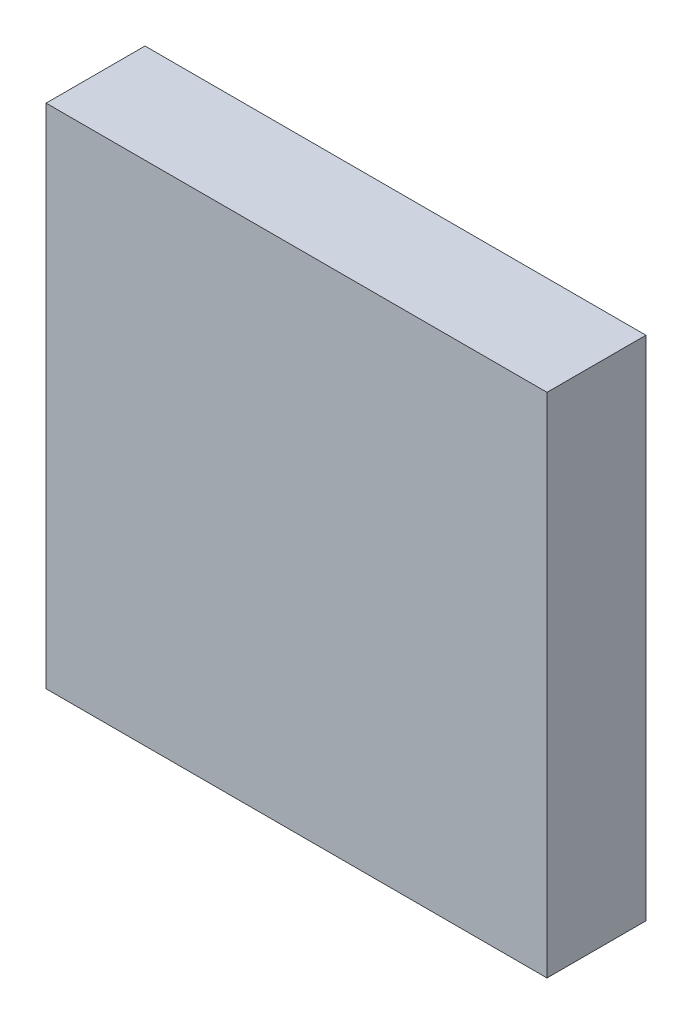
ISO-10303-21;
HEADER;
FILE_DESCRIPTION(('STEP AP214'),'2;1');
FILE_NAME('part.step','',(''),(''),'','','');
FILE_SCHEMA(('AUTOMOTIVE_DESIGN { 1 0 10303 214 1 1 1 1 }'));
ENDSEC;
DATA;
#1=APPLICATION_CONTEXT('core data for automotive mechanical design processes');
#2=APPLICATION_PROTOCOL_DEFINITION('international standard','automotive_design',2000,#1);
#3=PRODUCT_CONTEXT('',#1,'mechanical');
#4=PRODUCT('Part','Part','',(#3));
#5=PRODUCT_RELATED_PRODUCT_CATEGORY('part','',(#4));
#6=PRODUCT_DEFINITION_FORMATION('','',#4);
#7=PRODUCT_DEFINITION_CONTEXT('part definition',#1,'design');
#8=PRODUCT_DEFINITION('design','',#6,#7);
#9=PRODUCT_DEFINITION_SHAPE('','',#8);
#10=(LENGTH_UNIT() NAMED_UNIT(*) SI_UNIT(.MILLI.,.METRE.));
#11=(NAMED_UNIT(*) PLANE_ANGLE_UNIT() SI_UNIT($,.RADIAN.));
#12=(NAMED_UNIT(*) SI_UNIT($,.STERADIAN.) SOLID_ANGLE_UNIT());
#13=UNCERTAINTY_MEASURE_WITH_UNIT(LENGTH_MEASURE(1.E-05),#10,'distance_accuracy_value','');
#14=(GEOMETRIC_REPRESENTATION_CONTEXT(3) GLOBAL_UNCERTAINTY_ASSIGNED_CONTEXT((#13)) GLOBAL_UNIT_ASSIGNED_CONTEXT((#10,
#11,#12)) REPRESENTATION_CONTEXT('',''));
#15=CARTESIAN_POINT('',(0.,0.,0.));
#16=DIRECTION('',(0.,0.,1.));
#17=DIRECTION('',(1.,0.,0.));
#18=AXIS2_PLACEMENT_3D('',#15,#16,#17);
#19=CARTESIAN_POINT('',(-4.0513,4.1021,1.599946));
#20=DIRECTION('',(1.,0.,0.));
#21=DIRECTION('',(0.,0.,-1.));
#22=AXIS2_PLACEMENT_3D('',#19,#20,#21);
#23=PLANE('',#22);
#24=DIRECTION('',(0.,-1.,0.));
#25=VECTOR('',#24,1.);
#26=CARTESIAN_POINT('',(-4.0513,4.1021,0.));
#27=LINE('',#26,#25);
#28=CARTESIAN_POINT('',(-4.0513,4.1021,0.));
#29=VERTEX_POINT('',#28);
#30=CARTESIAN_POINT('',(-4.0513,-4.1021,0.));
#31=VERTEX_POINT('',#30);
#32=EDGE_CURVE('E95',#29,#31,#27,.T.);
#33=ORIENTED_EDGE('',*,*,#32,.T.);
#34=DIRECTION('',(0.,0.,-1.));
#35=VECTOR('',#34,1.);
#36=CARTESIAN_POINT('',(-4.0513,-4.1021,1.599946));
#37=LINE('',#36,#35);
#38=CARTESIAN_POINT('',(-4.0513,-4.1021,1.599946));
#39=VERTEX_POINT('',#38);
#40=EDGE_CURVE('E11',#39,#31,#37,.T.);
#41=ORIENTED_EDGE('',*,*,#40,.F.);
#42=DIRECTION('',(0.,-1.,0.));
#43=VECTOR('',#42,1.);
#44=CARTESIAN_POINT('',(-4.0513,4.1021,1.599946));
#45=LINE('',#44,#43);
#46=CARTESIAN_POINT('',(-4.0513,4.1021,1.599946));
#47=VERTEX_POINT('',#46);
#48=EDGE_CURVE('E83',#47,#39,#45,.T.);
#49=ORIENTED_EDGE('',*,*,#48,.F.);
#50=DIRECTION('',(0.,0.,-1.));
#51=VECTOR('',#50,1.);
#52=CARTESIAN_POINT('',(-4.0513,4.1021,1.599946));
#53=LINE('',#52,#51);
#54=EDGE_CURVE('E91',#47,#29,#53,.T.);
#55=ORIENTED_EDGE('',*,*,#54,.T.);
#56=EDGE_LOOP('',(#33,#41,#49,#55));
#57=FACE_BOUND('',#56,.T.);
#58=ADVANCED_FACE('F32',(#57),#23,.F.);
#59=CARTESIAN_POINT('',(-4.0513,-4.1021,1.599946));
#60=DIRECTION('',(0.,1.,0.));
#61=DIRECTION('',(0.,0.,1.));
#62=AXIS2_PLACEMENT_3D('',#59,#60,#61);
#63=PLANE('',#62);
#64=DIRECTION('',(1.,0.,0.));
#65=VECTOR('',#64,1.);
#66=CARTESIAN_POINT('',(-4.0513,-4.1021,0.));
#67=LINE('',#66,#65);
#68=CARTESIAN_POINT('',(4.0513,-4.1021,0.));
#69=VERTEX_POINT('',#68);
#70=EDGE_CURVE('E87',#31,#69,#67,.T.);
#71=ORIENTED_EDGE('',*,*,#70,.T.);
#72=DIRECTION('',(0.,0.,-1.));
#73=VECTOR('',#72,1.);
#74=CARTESIAN_POINT('',(4.0513,-4.1021,1.599946));
#75=LINE('',#74,#73);
#76=CARTESIAN_POINT('',(4.0513,-4.1021,1.599946));
#77=VERTEX_POINT('',#76);
#78=EDGE_CURVE('E40',#77,#69,#75,.T.);
#79=ORIENTED_EDGE('',*,*,#78,.F.);
#80=DIRECTION('',(1.,0.,0.));
#81=VECTOR('',#80,1.);
#82=CARTESIAN_POINT('',(-4.0513,-4.1021,1.599946));
#83=LINE('',#82,#81);
#84=EDGE_CURVE('E78',#39,#77,#83,.T.);
#85=ORIENTED_EDGE('',*,*,#84,.F.);
#86=ORIENTED_EDGE('',*,*,#40,.T.);
#87=EDGE_LOOP('',(#71,#79,#85,#86));
#88=FACE_BOUND('',#87,.T.);
#89=ADVANCED_FACE('F86',(#88),#63,.F.);
#90=CARTESIAN_POINT('',(4.0513,-4.1021,1.599946));
#91=DIRECTION('',(-1.,0.,0.));
#92=DIRECTION('',(0.,0.,1.));
#93=AXIS2_PLACEMENT_3D('',#90,#91,#92);
#94=PLANE('',#93);
#95=DIRECTION('',(0.,1.,0.));
#96=VECTOR('',#95,1.);
#97=CARTESIAN_POINT('',(4.0513,-4.1021,0.));
#98=LINE('',#97,#96);
#99=CARTESIAN_POINT('',(4.0513,4.1021,0.));
#100=VERTEX_POINT('',#99);
#101=EDGE_CURVE('E65',#69,#100,#98,.T.);
#102=ORIENTED_EDGE('',*,*,#101,.T.);
#103=DIRECTION('',(0.,0.,-1.));
#104=VECTOR('',#103,1.);
#105=CARTESIAN_POINT('',(4.0513,4.1021,1.599946));
#106=LINE('',#105,#104);
#107=CARTESIAN_POINT('',(4.0513,4.1021,1.599946));
#108=VERTEX_POINT('',#107);
#109=EDGE_CURVE('E88',#108,#100,#106,.T.);
#110=ORIENTED_EDGE('',*,*,#109,.F.);
#111=DIRECTION('',(0.,1.,0.));
#112=VECTOR('',#111,1.);
#113=CARTESIAN_POINT('',(4.0513,-4.1021,1.599946));
#114=LINE('',#113,#112);
#115=EDGE_CURVE('E81',#77,#108,#114,.T.);
#116=ORIENTED_EDGE('',*,*,#115,.F.);
#117=ORIENTED_EDGE('',*,*,#78,.T.);
#118=EDGE_LOOP('',(#102,#110,#116,#117));
#119=FACE_BOUND('',#118,.T.);
#120=ADVANCED_FACE('F89',(#119),#94,.F.);
#121=CARTESIAN_POINT('',(4.0513,4.1021,1.599946));
#122=DIRECTION('',(0.,-1.,0.));
#123=DIRECTION('',(0.,0.,-1.));
#124=AXIS2_PLACEMENT_3D('',#121,#122,#123);
#125=PLANE('',#124);
#126=DIRECTION('',(-1.,0.,0.));
#127=VECTOR('',#126,1.);
#128=CARTESIAN_POINT('',(4.0513,4.1021,0.));
#129=LINE('',#128,#127);
#130=EDGE_CURVE('E71',#100,#29,#129,.T.);
#131=ORIENTED_EDGE('',*,*,#130,.T.);
#132=ORIENTED_EDGE('',*,*,#54,.F.);
#133=DIRECTION('',(-1.,0.,0.));
#134=VECTOR('',#133,1.);
#135=CARTESIAN_POINT('',(4.0513,4.1021,1.599946));
#136=LINE('',#135,#134);
#137=EDGE_CURVE('E48',#108,#47,#136,.T.);
#138=ORIENTED_EDGE('',*,*,#137,.F.);
#139=ORIENTED_EDGE('',*,*,#109,.T.);
#140=EDGE_LOOP('',(#131,#132,#138,#139));
#141=FACE_BOUND('',#140,.T.);
#142=ADVANCED_FACE('F102',(#141),#125,.F.);
#143=CARTESIAN_POINT('',(0.,0.,1.599946));
#144=DIRECTION('',(0.,0.,1.));
#145=DIRECTION('',(1.,0.,0.));
#146=AXIS2_PLACEMENT_3D('',#143,#144,#145);
#147=PLANE('',#146);
#148=ORIENTED_EDGE('',*,*,#48,.T.);
#149=ORIENTED_EDGE('',*,*,#84,.T.);
#150=ORIENTED_EDGE('',*,*,#115,.T.);
#151=ORIENTED_EDGE('',*,*,#137,.T.);
#152=EDGE_LOOP('',(#148,#149,#150,#151));
#153=FACE_BOUND('',#152,.T.);
#154=ADVANCED_FACE('F79',(#153),#147,.T.);
#155=CARTESIAN_POINT('',(0.,0.,0.));
#156=DIRECTION('',(0.,0.,1.));
#157=DIRECTION('',(1.,0.,0.));
#158=AXIS2_PLACEMENT_3D('',#155,#156,#157);
#159=PLANE('',#158);
#160=ORIENTED_EDGE('',*,*,#32,.F.);
#161=ORIENTED_EDGE('',*,*,#130,.F.);
#162=ORIENTED_EDGE('',*,*,#101,.F.);
#163=ORIENTED_EDGE('',*,*,#70,.F.);
#164=EDGE_LOOP('',(#160,#161,#162,#163));
#165=FACE_BOUND('',#164,.T.);
#166=ADVANCED_FACE('F105',(#165),#159,.F.);
#167=CLOSED_SHELL('',(#58,#89,#120,#142,#154,#166));
#168=MANIFOLD_SOLID_BREP('B2',#167);
#169=ADVANCED_BREP_SHAPE_REPRESENTATION('',(#18,#168),#14);
#170=SHAPE_DEFINITION_REPRESENTATION(#9,#169);
ENDSEC;
END-ISO-10303-21;
